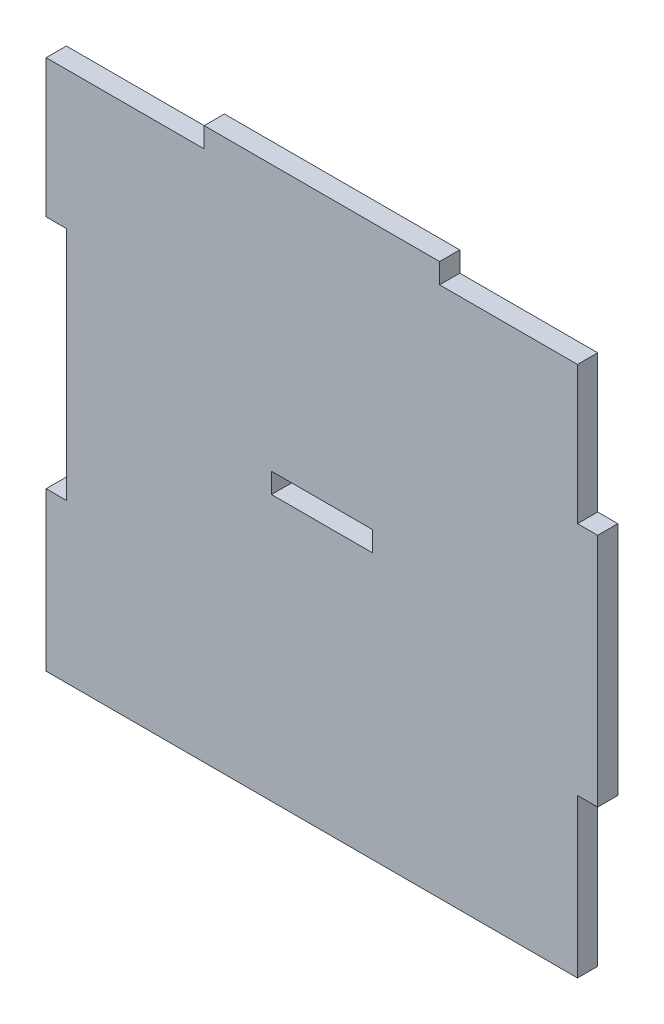
ISO-10303-21;
HEADER;
FILE_DESCRIPTION(('STEP AP214'),'2;1');
FILE_NAME('part.step','',(''),(''),'','','');
FILE_SCHEMA(('AUTOMOTIVE_DESIGN { 1 0 10303 214 1 1 1 1 }'));
ENDSEC;
DATA;
#1=APPLICATION_CONTEXT('core data for automotive mechanical design processes');
#2=APPLICATION_PROTOCOL_DEFINITION('international standard','automotive_design',2000,#1);
#3=PRODUCT_CONTEXT('',#1,'mechanical');
#4=PRODUCT('Part','Part','',(#3));
#5=PRODUCT_RELATED_PRODUCT_CATEGORY('part','',(#4));
#6=PRODUCT_DEFINITION_FORMATION('','',#4);
#7=PRODUCT_DEFINITION_CONTEXT('part definition',#1,'design');
#8=PRODUCT_DEFINITION('design','',#6,#7);
#9=PRODUCT_DEFINITION_SHAPE('','',#8);
#10=(LENGTH_UNIT() NAMED_UNIT(*) SI_UNIT(.MILLI.,.METRE.));
#11=(NAMED_UNIT(*) PLANE_ANGLE_UNIT() SI_UNIT($,.RADIAN.));
#12=(NAMED_UNIT(*) SI_UNIT($,.STERADIAN.) SOLID_ANGLE_UNIT());
#13=UNCERTAINTY_MEASURE_WITH_UNIT(LENGTH_MEASURE(1.E-05),#10,'distance_accuracy_value','');
#14=(GEOMETRIC_REPRESENTATION_CONTEXT(3) GLOBAL_UNCERTAINTY_ASSIGNED_CONTEXT((#13)) GLOBAL_UNIT_ASSIGNED_CONTEXT((#10,
#11,#12)) REPRESENTATION_CONTEXT('',''));
#15=CARTESIAN_POINT('',(0.,0.,0.));
#16=DIRECTION('',(0.,0.,1.));
#17=DIRECTION('',(1.,0.,0.));
#18=AXIS2_PLACEMENT_3D('',#15,#16,#17);
#19=CARTESIAN_POINT('',(38.,-16.,3.));
#20=DIRECTION('',(0.,1.,0.));
#21=DIRECTION('',(-1.,0.,0.));
#22=AXIS2_PLACEMENT_3D('',#19,#20,#21);
#23=PLANE('',#22);
#24=DIRECTION('',(1.,0.,0.));
#25=VECTOR('',#24,1.);
#26=CARTESIAN_POINT('',(38.,-16.,0.));
#27=LINE('',#26,#25);
#28=CARTESIAN_POINT('',(38.,-16.,0.));
#29=VERTEX_POINT('',#28);
#30=CARTESIAN_POINT('',(41.,-16.,0.));
#31=VERTEX_POINT('',#30);
#32=EDGE_CURVE('E218',#29,#31,#27,.T.);
#33=ORIENTED_EDGE('',*,*,#32,.T.);
#34=DIRECTION('',(0.,0.,-1.));
#35=VECTOR('',#34,1.);
#36=CARTESIAN_POINT('',(41.,-16.,3.));
#37=LINE('',#36,#35);
#38=CARTESIAN_POINT('',(41.,-16.,3.));
#39=VERTEX_POINT('',#38);
#40=EDGE_CURVE('E11',#39,#31,#37,.T.);
#41=ORIENTED_EDGE('',*,*,#40,.F.);
#42=DIRECTION('',(1.,0.,0.));
#43=VECTOR('',#42,1.);
#44=CARTESIAN_POINT('',(38.,-16.,3.));
#45=LINE('',#44,#43);
#46=CARTESIAN_POINT('',(38.,-16.,3.));
#47=VERTEX_POINT('',#46);
#48=EDGE_CURVE('E224',#47,#39,#45,.T.);
#49=ORIENTED_EDGE('',*,*,#48,.F.);
#50=DIRECTION('',(0.,0.,-1.));
#51=VECTOR('',#50,1.);
#52=CARTESIAN_POINT('',(38.,-16.,3.));
#53=LINE('',#52,#51);
#54=EDGE_CURVE('E274',#47,#29,#53,.T.);
#55=ORIENTED_EDGE('',*,*,#54,.T.);
#56=EDGE_LOOP('',(#33,#41,#49,#55));
#57=FACE_BOUND('',#56,.T.);
#58=ADVANCED_FACE('F38',(#57),#23,.F.);
#59=CARTESIAN_POINT('',(41.,16.,3.));
#60=DIRECTION('',(-1.,0.,0.));
#61=DIRECTION('',(0.,0.,1.));
#62=AXIS2_PLACEMENT_3D('',#59,#60,#61);
#63=PLANE('',#62);
#64=DIRECTION('',(0.,1.,0.));
#65=VECTOR('',#64,1.);
#66=CARTESIAN_POINT('',(41.,16.,0.));
#67=LINE('',#66,#65);
#68=CARTESIAN_POINT('',(41.,19.,0.));
#69=VERTEX_POINT('',#68);
#70=EDGE_CURVE('E278',#31,#69,#67,.T.);
#71=ORIENTED_EDGE('',*,*,#70,.T.);
#72=DIRECTION('',(0.,0.,-1.));
#73=VECTOR('',#72,1.);
#74=CARTESIAN_POINT('',(41.,19.,3.));
#75=LINE('',#74,#73);
#76=CARTESIAN_POINT('',(41.,19.,3.));
#77=VERTEX_POINT('',#76);
#78=EDGE_CURVE('E46',#77,#69,#75,.T.);
#79=ORIENTED_EDGE('',*,*,#78,.F.);
#80=DIRECTION('',(0.,1.,0.));
#81=VECTOR('',#80,1.);
#82=CARTESIAN_POINT('',(41.,16.,3.));
#83=LINE('',#82,#81);
#84=EDGE_CURVE('E228',#39,#77,#83,.T.);
#85=ORIENTED_EDGE('',*,*,#84,.F.);
#86=ORIENTED_EDGE('',*,*,#40,.T.);
#87=EDGE_LOOP('',(#71,#79,#85,#86));
#88=FACE_BOUND('',#87,.T.);
#89=ADVANCED_FACE('F407',(#88),#63,.F.);
#90=CARTESIAN_POINT('',(41.,19.,3.));
#91=DIRECTION('',(0.,-1.,0.));
#92=DIRECTION('',(0.,0.,-1.));
#93=AXIS2_PLACEMENT_3D('',#90,#91,#92);
#94=PLANE('',#93);
#95=DIRECTION('',(-1.,0.,0.));
#96=VECTOR('',#95,1.);
#97=CARTESIAN_POINT('',(41.,19.,0.));
#98=LINE('',#97,#96);
#99=CARTESIAN_POINT('',(38.,19.,0.));
#100=VERTEX_POINT('',#99);
#101=EDGE_CURVE('E281',#69,#100,#98,.T.);
#102=ORIENTED_EDGE('',*,*,#101,.T.);
#103=DIRECTION('',(0.,0.,-1.));
#104=VECTOR('',#103,1.);
#105=CARTESIAN_POINT('',(38.,19.,3.));
#106=LINE('',#105,#104);
#107=CARTESIAN_POINT('',(38.,19.,3.));
#108=VERTEX_POINT('',#107);
#109=EDGE_CURVE('E377',#108,#100,#106,.T.);
#110=ORIENTED_EDGE('',*,*,#109,.F.);
#111=DIRECTION('',(-1.,0.,0.));
#112=VECTOR('',#111,1.);
#113=CARTESIAN_POINT('',(41.,19.,3.));
#114=LINE('',#113,#112);
#115=EDGE_CURVE('E232',#77,#108,#114,.T.);
#116=ORIENTED_EDGE('',*,*,#115,.F.);
#117=ORIENTED_EDGE('',*,*,#78,.T.);
#118=EDGE_LOOP('',(#102,#110,#116,#117));
#119=FACE_BOUND('',#118,.T.);
#120=ADVANCED_FACE('F386',(#119),#94,.F.);
#121=CARTESIAN_POINT('',(38.,39.5,3.));
#122=DIRECTION('',(-1.,0.,0.));
#123=DIRECTION('',(0.,-1.,0.));
#124=AXIS2_PLACEMENT_3D('',#121,#122,#123);
#125=PLANE('',#124);
#126=DIRECTION('',(0.,1.,0.));
#127=VECTOR('',#126,1.);
#128=CARTESIAN_POINT('',(38.,39.5,0.));
#129=LINE('',#128,#127);
#130=CARTESIAN_POINT('',(38.,39.5,0.));
#131=VERTEX_POINT('',#130);
#132=EDGE_CURVE('E284',#100,#131,#129,.T.);
#133=ORIENTED_EDGE('',*,*,#132,.T.);
#134=DIRECTION('',(0.,0.,-1.));
#135=VECTOR('',#134,1.);
#136=CARTESIAN_POINT('',(38.,39.5,3.));
#137=LINE('',#136,#135);
#138=CARTESIAN_POINT('',(38.,39.5,3.));
#139=VERTEX_POINT('',#138);
#140=EDGE_CURVE('E373',#139,#131,#137,.T.);
#141=ORIENTED_EDGE('',*,*,#140,.F.);
#142=DIRECTION('',(0.,1.,0.));
#143=VECTOR('',#142,1.);
#144=CARTESIAN_POINT('',(38.,39.5,3.));
#145=LINE('',#144,#143);
#146=EDGE_CURVE('E235',#108,#139,#145,.T.);
#147=ORIENTED_EDGE('',*,*,#146,.F.);
#148=ORIENTED_EDGE('',*,*,#109,.T.);
#149=EDGE_LOOP('',(#133,#141,#147,#148));
#150=FACE_BOUND('',#149,.T.);
#151=ADVANCED_FACE('F395',(#150),#125,.F.);
#152=CARTESIAN_POINT('',(17.5,39.5,3.));
#153=DIRECTION('',(0.,-1.,0.));
#154=DIRECTION('',(1.,0.,0.));
#155=AXIS2_PLACEMENT_3D('',#152,#153,#154);
#156=PLANE('',#155);
#157=DIRECTION('',(-1.,0.,0.));
#158=VECTOR('',#157,1.);
#159=CARTESIAN_POINT('',(17.5,39.5,0.));
#160=LINE('',#159,#158);
#161=CARTESIAN_POINT('',(17.5,39.5,0.));
#162=VERTEX_POINT('',#161);
#163=EDGE_CURVE('E287',#131,#162,#160,.T.);
#164=ORIENTED_EDGE('',*,*,#163,.T.);
#165=DIRECTION('',(0.,0.,-1.));
#166=VECTOR('',#165,1.);
#167=CARTESIAN_POINT('',(17.5,39.5,3.));
#168=LINE('',#167,#166);
#169=CARTESIAN_POINT('',(17.5,39.5,3.));
#170=VERTEX_POINT('',#169);
#171=EDGE_CURVE('E369',#170,#162,#168,.T.);
#172=ORIENTED_EDGE('',*,*,#171,.F.);
#173=DIRECTION('',(-1.,0.,0.));
#174=VECTOR('',#173,1.);
#175=CARTESIAN_POINT('',(17.5,39.5,3.));
#176=LINE('',#175,#174);
#177=EDGE_CURVE('E238',#139,#170,#176,.T.);
#178=ORIENTED_EDGE('',*,*,#177,.F.);
#179=ORIENTED_EDGE('',*,*,#140,.T.);
#180=EDGE_LOOP('',(#164,#172,#178,#179));
#181=FACE_BOUND('',#180,.T.);
#182=ADVANCED_FACE('F399',(#181),#156,.F.);
#183=CARTESIAN_POINT('',(17.5,42.5,3.));
#184=DIRECTION('',(-1.,0.,0.));
#185=DIRECTION('',(0.,-1.,0.));
#186=AXIS2_PLACEMENT_3D('',#183,#184,#185);
#187=PLANE('',#186);
#188=DIRECTION('',(0.,1.,0.));
#189=VECTOR('',#188,1.);
#190=CARTESIAN_POINT('',(17.5,42.5,0.));
#191=LINE('',#190,#189);
#192=CARTESIAN_POINT('',(17.5,42.5,0.));
#193=VERTEX_POINT('',#192);
#194=EDGE_CURVE('E290',#162,#193,#191,.T.);
#195=ORIENTED_EDGE('',*,*,#194,.T.);
#196=DIRECTION('',(0.,0.,-1.));
#197=VECTOR('',#196,1.);
#198=CARTESIAN_POINT('',(17.5,42.5,3.));
#199=LINE('',#198,#197);
#200=CARTESIAN_POINT('',(17.5,42.5,3.));
#201=VERTEX_POINT('',#200);
#202=EDGE_CURVE('E365',#201,#193,#199,.T.);
#203=ORIENTED_EDGE('',*,*,#202,.F.);
#204=DIRECTION('',(0.,1.,0.));
#205=VECTOR('',#204,1.);
#206=CARTESIAN_POINT('',(17.5,42.5,3.));
#207=LINE('',#206,#205);
#208=EDGE_CURVE('E241',#170,#201,#207,.T.);
#209=ORIENTED_EDGE('',*,*,#208,.F.);
#210=ORIENTED_EDGE('',*,*,#171,.T.);
#211=EDGE_LOOP('',(#195,#203,#209,#210));
#212=FACE_BOUND('',#211,.T.);
#213=ADVANCED_FACE('F456',(#212),#187,.F.);
#214=CARTESIAN_POINT('',(-17.5,42.5,3.));
#215=DIRECTION('',(0.,-1.,0.));
#216=DIRECTION('',(0.,0.,-1.));
#217=AXIS2_PLACEMENT_3D('',#214,#215,#216);
#218=PLANE('',#217);
#219=DIRECTION('',(-1.,0.,0.));
#220=VECTOR('',#219,1.);
#221=CARTESIAN_POINT('',(-17.5,42.5,0.));
#222=LINE('',#221,#220);
#223=CARTESIAN_POINT('',(-17.5,42.5,0.));
#224=VERTEX_POINT('',#223);
#225=EDGE_CURVE('E293',#193,#224,#222,.T.);
#226=ORIENTED_EDGE('',*,*,#225,.T.);
#227=DIRECTION('',(0.,0.,-1.));
#228=VECTOR('',#227,1.);
#229=CARTESIAN_POINT('',(-17.5,42.5,3.));
#230=LINE('',#229,#228);
#231=CARTESIAN_POINT('',(-17.5,42.5,3.));
#232=VERTEX_POINT('',#231);
#233=EDGE_CURVE('E361',#232,#224,#230,.T.);
#234=ORIENTED_EDGE('',*,*,#233,.F.);
#235=DIRECTION('',(-1.,0.,0.));
#236=VECTOR('',#235,1.);
#237=CARTESIAN_POINT('',(-17.5,42.5,3.));
#238=LINE('',#237,#236);
#239=EDGE_CURVE('E244',#201,#232,#238,.T.);
#240=ORIENTED_EDGE('',*,*,#239,.F.);
#241=ORIENTED_EDGE('',*,*,#202,.T.);
#242=EDGE_LOOP('',(#226,#234,#240,#241));
#243=FACE_BOUND('',#242,.T.);
#244=ADVANCED_FACE('F454',(#243),#218,.F.);
#245=CARTESIAN_POINT('',(-17.5,39.5,3.));
#246=DIRECTION('',(1.,0.,0.));
#247=DIRECTION('',(0.,0.,-1.));
#248=AXIS2_PLACEMENT_3D('',#245,#246,#247);
#249=PLANE('',#248);
#250=DIRECTION('',(0.,-1.,0.));
#251=VECTOR('',#250,1.);
#252=CARTESIAN_POINT('',(-17.5,39.5,0.));
#253=LINE('',#252,#251);
#254=CARTESIAN_POINT('',(-17.5,39.5,0.));
#255=VERTEX_POINT('',#254);
#256=EDGE_CURVE('E296',#224,#255,#253,.T.);
#257=ORIENTED_EDGE('',*,*,#256,.T.);
#258=DIRECTION('',(0.,0.,-1.));
#259=VECTOR('',#258,1.);
#260=CARTESIAN_POINT('',(-17.5,39.5,3.));
#261=LINE('',#260,#259);
#262=CARTESIAN_POINT('',(-17.5,39.5,3.));
#263=VERTEX_POINT('',#262);
#264=EDGE_CURVE('E357',#263,#255,#261,.T.);
#265=ORIENTED_EDGE('',*,*,#264,.F.);
#266=DIRECTION('',(0.,-1.,0.));
#267=VECTOR('',#266,1.);
#268=CARTESIAN_POINT('',(-17.5,39.5,3.));
#269=LINE('',#268,#267);
#270=EDGE_CURVE('E247',#232,#263,#269,.T.);
#271=ORIENTED_EDGE('',*,*,#270,.F.);
#272=ORIENTED_EDGE('',*,*,#233,.T.);
#273=EDGE_LOOP('',(#257,#265,#271,#272));
#274=FACE_BOUND('',#273,.T.);
#275=ADVANCED_FACE('F447',(#274),#249,.F.);
#276=CARTESIAN_POINT('',(-41.,39.5,3.));
#277=DIRECTION('',(0.,-1.,0.));
#278=DIRECTION('',(0.,0.,-1.));
#279=AXIS2_PLACEMENT_3D('',#276,#277,#278);
#280=PLANE('',#279);
#281=DIRECTION('',(-1.,0.,0.));
#282=VECTOR('',#281,1.);
#283=CARTESIAN_POINT('',(-41.,39.5,0.));
#284=LINE('',#283,#282);
#285=CARTESIAN_POINT('',(-41.,39.5,0.));
#286=VERTEX_POINT('',#285);
#287=EDGE_CURVE('E300',#255,#286,#284,.T.);
#288=ORIENTED_EDGE('',*,*,#287,.T.);
#289=DIRECTION('',(0.,0.,-1.));
#290=VECTOR('',#289,1.);
#291=CARTESIAN_POINT('',(-41.,39.5,3.));
#292=LINE('',#291,#290);
#293=CARTESIAN_POINT('',(-41.,39.5,3.));
#294=VERTEX_POINT('',#293);
#295=EDGE_CURVE('E353',#294,#286,#292,.T.);
#296=ORIENTED_EDGE('',*,*,#295,.F.);
#297=DIRECTION('',(-1.,0.,0.));
#298=VECTOR('',#297,1.);
#299=CARTESIAN_POINT('',(-38.,39.5,3.));
#300=LINE('',#299,#298);
#301=EDGE_CURVE('E250',#263,#294,#300,.T.);
#302=ORIENTED_EDGE('',*,*,#301,.F.);
#303=ORIENTED_EDGE('',*,*,#264,.T.);
#304=EDGE_LOOP('',(#288,#296,#302,#303));
#305=FACE_BOUND('',#304,.T.);
#306=ADVANCED_FACE('F451',(#305),#280,.F.);
#307=CARTESIAN_POINT('',(-41.,19.,3.));
#308=DIRECTION('',(1.,0.,0.));
#309=DIRECTION('',(0.,1.,0.));
#310=AXIS2_PLACEMENT_3D('',#307,#308,#309);
#311=PLANE('',#310);
#312=DIRECTION('',(0.,-1.,0.));
#313=VECTOR('',#312,1.);
#314=CARTESIAN_POINT('',(-41.,19.,0.));
#315=LINE('',#314,#313);
#316=CARTESIAN_POINT('',(-41.,19.,0.));
#317=VERTEX_POINT('',#316);
#318=EDGE_CURVE('E303',#286,#317,#315,.T.);
#319=ORIENTED_EDGE('',*,*,#318,.T.);
#320=DIRECTION('',(0.,0.,-1.));
#321=VECTOR('',#320,1.);
#322=CARTESIAN_POINT('',(-41.,19.,3.));
#323=LINE('',#322,#321);
#324=CARTESIAN_POINT('',(-41.,19.,3.));
#325=VERTEX_POINT('',#324);
#326=EDGE_CURVE('E349',#325,#317,#323,.T.);
#327=ORIENTED_EDGE('',*,*,#326,.F.);
#328=DIRECTION('',(0.,-1.,0.));
#329=VECTOR('',#328,1.);
#330=CARTESIAN_POINT('',(-41.,19.,3.));
#331=LINE('',#330,#329);
#332=EDGE_CURVE('E253',#294,#325,#331,.T.);
#333=ORIENTED_EDGE('',*,*,#332,.F.);
#334=ORIENTED_EDGE('',*,*,#295,.T.);
#335=EDGE_LOOP('',(#319,#327,#333,#334));
#336=FACE_BOUND('',#335,.T.);
#337=ADVANCED_FACE('F440',(#336),#311,.F.);
#338=CARTESIAN_POINT('',(-38.,19.,3.));
#339=DIRECTION('',(0.,1.,0.));
#340=DIRECTION('',(-1.,0.,0.));
#341=AXIS2_PLACEMENT_3D('',#338,#339,#340);
#342=PLANE('',#341);
#343=DIRECTION('',(1.,0.,0.));
#344=VECTOR('',#343,1.);
#345=CARTESIAN_POINT('',(-38.,19.,0.));
#346=LINE('',#345,#344);
#347=CARTESIAN_POINT('',(-38.,19.,0.));
#348=VERTEX_POINT('',#347);
#349=EDGE_CURVE('E306',#317,#348,#346,.T.);
#350=ORIENTED_EDGE('',*,*,#349,.T.);
#351=DIRECTION('',(0.,0.,-1.));
#352=VECTOR('',#351,1.);
#353=CARTESIAN_POINT('',(-38.,19.,3.));
#354=LINE('',#353,#352);
#355=CARTESIAN_POINT('',(-38.,19.,3.));
#356=VERTEX_POINT('',#355);
#357=EDGE_CURVE('E345',#356,#348,#354,.T.);
#358=ORIENTED_EDGE('',*,*,#357,.F.);
#359=DIRECTION('',(1.,0.,0.));
#360=VECTOR('',#359,1.);
#361=CARTESIAN_POINT('',(-38.,19.,3.));
#362=LINE('',#361,#360);
#363=EDGE_CURVE('E256',#325,#356,#362,.T.);
#364=ORIENTED_EDGE('',*,*,#363,.F.);
#365=ORIENTED_EDGE('',*,*,#326,.T.);
#366=EDGE_LOOP('',(#350,#358,#364,#365));
#367=FACE_BOUND('',#366,.T.);
#368=ADVANCED_FACE('F435',(#367),#342,.F.);
#369=CARTESIAN_POINT('',(-38.,16.,3.));
#370=DIRECTION('',(1.,0.,0.));
#371=DIRECTION('',(0.,0.,-1.));
#372=AXIS2_PLACEMENT_3D('',#369,#370,#371);
#373=PLANE('',#372);
#374=DIRECTION('',(0.,-1.,0.));
#375=VECTOR('',#374,1.);
#376=CARTESIAN_POINT('',(-38.,16.,0.));
#377=LINE('',#376,#375);
#378=CARTESIAN_POINT('',(-38.,-16.,0.));
#379=VERTEX_POINT('',#378);
#380=EDGE_CURVE('E310',#348,#379,#377,.T.);
#381=ORIENTED_EDGE('',*,*,#380,.T.);
#382=DIRECTION('',(0.,0.,-1.));
#383=VECTOR('',#382,1.);
#384=CARTESIAN_POINT('',(-38.,-16.,3.));
#385=LINE('',#384,#383);
#386=CARTESIAN_POINT('',(-38.,-16.,3.));
#387=VERTEX_POINT('',#386);
#388=EDGE_CURVE('E341',#387,#379,#385,.T.);
#389=ORIENTED_EDGE('',*,*,#388,.F.);
#390=DIRECTION('',(0.,-1.,0.));
#391=VECTOR('',#390,1.);
#392=CARTESIAN_POINT('',(-38.,16.,3.));
#393=LINE('',#392,#391);
#394=EDGE_CURVE('E259',#356,#387,#393,.T.);
#395=ORIENTED_EDGE('',*,*,#394,.F.);
#396=ORIENTED_EDGE('',*,*,#357,.T.);
#397=EDGE_LOOP('',(#381,#389,#395,#396));
#398=FACE_BOUND('',#397,.T.);
#399=ADVANCED_FACE('F430',(#398),#373,.F.);
#400=CARTESIAN_POINT('',(-41.,-16.,3.));
#401=DIRECTION('',(0.,-1.,0.));
#402=DIRECTION('',(0.,0.,-1.));
#403=AXIS2_PLACEMENT_3D('',#400,#401,#402);
#404=PLANE('',#403);
#405=DIRECTION('',(-1.,0.,0.));
#406=VECTOR('',#405,1.);
#407=CARTESIAN_POINT('',(-41.,-16.,0.));
#408=LINE('',#407,#406);
#409=CARTESIAN_POINT('',(-41.,-16.,0.));
#410=VERTEX_POINT('',#409);
#411=EDGE_CURVE('E313',#379,#410,#408,.T.);
#412=ORIENTED_EDGE('',*,*,#411,.T.);
#413=DIRECTION('',(0.,0.,-1.));
#414=VECTOR('',#413,1.);
#415=CARTESIAN_POINT('',(-41.,-16.,3.));
#416=LINE('',#415,#414);
#417=CARTESIAN_POINT('',(-41.,-16.,3.));
#418=VERTEX_POINT('',#417);
#419=EDGE_CURVE('E337',#418,#410,#416,.T.);
#420=ORIENTED_EDGE('',*,*,#419,.F.);
#421=DIRECTION('',(-1.,0.,0.));
#422=VECTOR('',#421,1.);
#423=CARTESIAN_POINT('',(-41.,-16.,3.));
#424=LINE('',#423,#422);
#425=EDGE_CURVE('E262',#387,#418,#424,.T.);
#426=ORIENTED_EDGE('',*,*,#425,.F.);
#427=ORIENTED_EDGE('',*,*,#388,.T.);
#428=EDGE_LOOP('',(#412,#420,#426,#427));
#429=FACE_BOUND('',#428,.T.);
#430=ADVANCED_FACE('F426',(#429),#404,.F.);
#431=CARTESIAN_POINT('',(-41.,-19.,3.));
#432=DIRECTION('',(1.,0.,0.));
#433=DIRECTION('',(0.,1.,0.));
#434=AXIS2_PLACEMENT_3D('',#431,#432,#433);
#435=PLANE('',#434);
#436=DIRECTION('',(0.,-1.,0.));
#437=VECTOR('',#436,1.);
#438=CARTESIAN_POINT('',(-41.,-19.,0.));
#439=LINE('',#438,#437);
#440=CARTESIAN_POINT('',(-41.,-39.5,0.));
#441=VERTEX_POINT('',#440);
#442=EDGE_CURVE('E317',#410,#441,#439,.T.);
#443=ORIENTED_EDGE('',*,*,#442,.T.);
#444=DIRECTION('',(0.,0.,-1.));
#445=VECTOR('',#444,1.);
#446=CARTESIAN_POINT('',(-41.,-39.5,3.));
#447=LINE('',#446,#445);
#448=CARTESIAN_POINT('',(-41.,-39.5,3.));
#449=VERTEX_POINT('',#448);
#450=EDGE_CURVE('E333',#449,#441,#447,.T.);
#451=ORIENTED_EDGE('',*,*,#450,.F.);
#452=DIRECTION('',(0.,-1.,0.));
#453=VECTOR('',#452,1.);
#454=CARTESIAN_POINT('',(-41.,-19.,3.));
#455=LINE('',#454,#453);
#456=EDGE_CURVE('E265',#418,#449,#455,.T.);
#457=ORIENTED_EDGE('',*,*,#456,.F.);
#458=ORIENTED_EDGE('',*,*,#419,.T.);
#459=EDGE_LOOP('',(#443,#451,#457,#458));
#460=FACE_BOUND('',#459,.T.);
#461=ADVANCED_FACE('F423',(#460),#435,.F.);
#462=CARTESIAN_POINT('',(-41.,-39.5,3.));
#463=DIRECTION('',(0.,1.,0.));
#464=DIRECTION('',(0.,0.,1.));
#465=AXIS2_PLACEMENT_3D('',#462,#463,#464);
#466=PLANE('',#465);
#467=DIRECTION('',(1.,0.,0.));
#468=VECTOR('',#467,1.);
#469=CARTESIAN_POINT('',(-41.,-39.5,0.));
#470=LINE('',#469,#468);
#471=CARTESIAN_POINT('',(38.,-39.5,0.));
#472=VERTEX_POINT('',#471);
#473=EDGE_CURVE('E320',#441,#472,#470,.T.);
#474=ORIENTED_EDGE('',*,*,#473,.T.);
#475=DIRECTION('',(0.,0.,-1.));
#476=VECTOR('',#475,1.);
#477=CARTESIAN_POINT('',(38.,-39.5,3.));
#478=LINE('',#477,#476);
#479=CARTESIAN_POINT('',(38.,-39.5,3.));
#480=VERTEX_POINT('',#479);
#481=EDGE_CURVE('E329',#480,#472,#478,.T.);
#482=ORIENTED_EDGE('',*,*,#481,.F.);
#483=DIRECTION('',(1.,0.,0.));
#484=VECTOR('',#483,1.);
#485=CARTESIAN_POINT('',(-41.,-39.5,3.));
#486=LINE('',#485,#484);
#487=EDGE_CURVE('E268',#449,#480,#486,.T.);
#488=ORIENTED_EDGE('',*,*,#487,.F.);
#489=ORIENTED_EDGE('',*,*,#450,.T.);
#490=EDGE_LOOP('',(#474,#482,#488,#489));
#491=FACE_BOUND('',#490,.T.);
#492=ADVANCED_FACE('F414',(#491),#466,.F.);
#493=CARTESIAN_POINT('',(38.,-19.,3.));
#494=DIRECTION('',(-1.,0.,0.));
#495=DIRECTION('',(0.,-1.,0.));
#496=AXIS2_PLACEMENT_3D('',#493,#494,#495);
#497=PLANE('',#496);
#498=DIRECTION('',(0.,1.,0.));
#499=VECTOR('',#498,1.);
#500=CARTESIAN_POINT('',(38.,-19.,0.));
#501=LINE('',#500,#499);
#502=EDGE_CURVE('E229',#472,#29,#501,.T.);
#503=ORIENTED_EDGE('',*,*,#502,.T.);
#504=ORIENTED_EDGE('',*,*,#54,.F.);
#505=DIRECTION('',(0.,1.,0.));
#506=VECTOR('',#505,1.);
#507=CARTESIAN_POINT('',(38.,-19.,3.));
#508=LINE('',#507,#506);
#509=EDGE_CURVE('E271',#480,#47,#508,.T.);
#510=ORIENTED_EDGE('',*,*,#509,.F.);
#511=ORIENTED_EDGE('',*,*,#481,.T.);
#512=EDGE_LOOP('',(#503,#504,#510,#511));
#513=FACE_BOUND('',#512,.T.);
#514=ADVANCED_FACE('F418',(#513),#497,.F.);
#515=CARTESIAN_POINT('',(0.,0.,3.));
#516=DIRECTION('',(0.,0.,-1.));
#517=DIRECTION('',(-1.,0.,0.));
#518=AXIS2_PLACEMENT_3D('',#515,#516,#517);
#519=PLANE('',#518);
#520=DIRECTION('',(-1.,0.,0.));
#521=VECTOR('',#520,1.);
#522=CARTESIAN_POINT('',(-7.5,3.,3.));
#523=LINE('',#522,#521);
#524=CARTESIAN_POINT('',(7.5,3.,3.));
#525=VERTEX_POINT('',#524);
#526=CARTESIAN_POINT('',(-7.5,3.,3.));
#527=VERTEX_POINT('',#526);
#528=EDGE_CURVE('E209',#525,#527,#523,.T.);
#529=ORIENTED_EDGE('',*,*,#528,.F.);
#530=DIRECTION('',(0.,1.,0.));
#531=VECTOR('',#530,1.);
#532=CARTESIAN_POINT('',(7.5,3.,3.));
#533=LINE('',#532,#531);
#534=CARTESIAN_POINT('',(7.5,0.,3.));
#535=VERTEX_POINT('',#534);
#536=EDGE_CURVE('E53',#535,#525,#533,.T.);
#537=ORIENTED_EDGE('',*,*,#536,.F.);
#538=DIRECTION('',(1.,0.,0.));
#539=VECTOR('',#538,1.);
#540=CARTESIAN_POINT('',(-7.5,0.,3.));
#541=LINE('',#540,#539);
#542=CARTESIAN_POINT('',(-7.5,0.,3.));
#543=VERTEX_POINT('',#542);
#544=EDGE_CURVE('E196',#543,#535,#541,.T.);
#545=ORIENTED_EDGE('',*,*,#544,.F.);
#546=DIRECTION('',(0.,-1.,0.));
#547=VECTOR('',#546,1.);
#548=CARTESIAN_POINT('',(-7.5,3.,3.));
#549=LINE('',#548,#547);
#550=EDGE_CURVE('E200',#527,#543,#549,.T.);
#551=ORIENTED_EDGE('',*,*,#550,.F.);
#552=EDGE_LOOP('',(#529,#537,#545,#551));
#553=FACE_BOUND('',#552,.T.);
#554=ORIENTED_EDGE('',*,*,#48,.T.);
#555=ORIENTED_EDGE('',*,*,#84,.T.);
#556=ORIENTED_EDGE('',*,*,#115,.T.);
#557=ORIENTED_EDGE('',*,*,#146,.T.);
#558=ORIENTED_EDGE('',*,*,#177,.T.);
#559=ORIENTED_EDGE('',*,*,#208,.T.);
#560=ORIENTED_EDGE('',*,*,#239,.T.);
#561=ORIENTED_EDGE('',*,*,#270,.T.);
#562=ORIENTED_EDGE('',*,*,#301,.T.);
#563=ORIENTED_EDGE('',*,*,#332,.T.);
#564=ORIENTED_EDGE('',*,*,#363,.T.);
#565=ORIENTED_EDGE('',*,*,#394,.T.);
#566=ORIENTED_EDGE('',*,*,#425,.T.);
#567=ORIENTED_EDGE('',*,*,#456,.T.);
#568=ORIENTED_EDGE('',*,*,#487,.T.);
#569=ORIENTED_EDGE('',*,*,#509,.T.);
#570=EDGE_LOOP('',(#554,#555,#556,#557,#558,#559,#560,#561,#562,#563,#564,#565,#566,#567,#568,#569));
#571=FACE_BOUND('',#570,.T.);
#572=ADVANCED_FACE('F403',(#553,#571),#519,.F.);
#573=CARTESIAN_POINT('',(0.,0.,0.));
#574=DIRECTION('',(0.,0.,-1.));
#575=DIRECTION('',(-1.,0.,0.));
#576=AXIS2_PLACEMENT_3D('',#573,#574,#575);
#577=PLANE('',#576);
#578=DIRECTION('',(0.,1.,0.));
#579=VECTOR('',#578,1.);
#580=CARTESIAN_POINT('',(7.5,3.,0.));
#581=LINE('',#580,#579);
#582=CARTESIAN_POINT('',(7.5,0.,0.));
#583=VERTEX_POINT('',#582);
#584=CARTESIAN_POINT('',(7.5,3.,0.));
#585=VERTEX_POINT('',#584);
#586=EDGE_CURVE('E177',#583,#585,#581,.T.);
#587=ORIENTED_EDGE('',*,*,#586,.T.);
#588=DIRECTION('',(-1.,0.,0.));
#589=VECTOR('',#588,1.);
#590=CARTESIAN_POINT('',(-7.5,3.,0.));
#591=LINE('',#590,#589);
#592=CARTESIAN_POINT('',(-7.5,3.,0.));
#593=VERTEX_POINT('',#592);
#594=EDGE_CURVE('E187',#585,#593,#591,.T.);
#595=ORIENTED_EDGE('',*,*,#594,.T.);
#596=DIRECTION('',(0.,-1.,0.));
#597=VECTOR('',#596,1.);
#598=CARTESIAN_POINT('',(-7.5,3.,0.));
#599=LINE('',#598,#597);
#600=CARTESIAN_POINT('',(-7.5,0.,0.));
#601=VERTEX_POINT('',#600);
#602=EDGE_CURVE('E61',#593,#601,#599,.T.);
#603=ORIENTED_EDGE('',*,*,#602,.T.);
#604=DIRECTION('',(1.,0.,0.));
#605=VECTOR('',#604,1.);
#606=CARTESIAN_POINT('',(-7.5,0.,0.));
#607=LINE('',#606,#605);
#608=EDGE_CURVE('E184',#601,#583,#607,.T.);
#609=ORIENTED_EDGE('',*,*,#608,.T.);
#610=EDGE_LOOP('',(#587,#595,#603,#609));
#611=FACE_BOUND('',#610,.T.);
#612=ORIENTED_EDGE('',*,*,#32,.F.);
#613=ORIENTED_EDGE('',*,*,#502,.F.);
#614=ORIENTED_EDGE('',*,*,#473,.F.);
#615=ORIENTED_EDGE('',*,*,#442,.F.);
#616=ORIENTED_EDGE('',*,*,#411,.F.);
#617=ORIENTED_EDGE('',*,*,#380,.F.);
#618=ORIENTED_EDGE('',*,*,#349,.F.);
#619=ORIENTED_EDGE('',*,*,#318,.F.);
#620=ORIENTED_EDGE('',*,*,#287,.F.);
#621=ORIENTED_EDGE('',*,*,#256,.F.);
#622=ORIENTED_EDGE('',*,*,#225,.F.);
#623=ORIENTED_EDGE('',*,*,#194,.F.);
#624=ORIENTED_EDGE('',*,*,#163,.F.);
#625=ORIENTED_EDGE('',*,*,#132,.F.);
#626=ORIENTED_EDGE('',*,*,#101,.F.);
#627=ORIENTED_EDGE('',*,*,#70,.F.);
#628=EDGE_LOOP('',(#612,#613,#614,#615,#616,#617,#618,#619,#620,#621,#622,#623,#624,#625,#626,#627));
#629=FACE_BOUND('',#628,.T.);
#630=ADVANCED_FACE('F192',(#611,#629),#577,.T.);
#631=CARTESIAN_POINT('',(7.5,3.,0.));
#632=DIRECTION('',(1.,0.,0.));
#633=DIRECTION('',(0.,1.,0.));
#634=AXIS2_PLACEMENT_3D('',#631,#632,#633);
#635=PLANE('',#634);
#636=ORIENTED_EDGE('',*,*,#536,.T.);
#637=DIRECTION('',(0.,0.,1.));
#638=VECTOR('',#637,1.);
#639=CARTESIAN_POINT('',(7.5,3.,0.));
#640=LINE('',#639,#638);
#641=EDGE_CURVE('E173',#585,#525,#640,.T.);
#642=ORIENTED_EDGE('',*,*,#641,.F.);
#643=ORIENTED_EDGE('',*,*,#586,.F.);
#644=DIRECTION('',(0.,0.,1.));
#645=VECTOR('',#644,1.);
#646=CARTESIAN_POINT('',(7.5,0.,0.));
#647=LINE('',#646,#645);
#648=EDGE_CURVE('E215',#583,#535,#647,.T.);
#649=ORIENTED_EDGE('',*,*,#648,.T.);
#650=EDGE_LOOP('',(#636,#642,#643,#649));
#651=FACE_BOUND('',#650,.T.);
#652=ADVANCED_FACE('F175',(#651),#635,.F.);
#653=CARTESIAN_POINT('',(-7.5,0.,0.));
#654=DIRECTION('',(0.,-1.,0.));
#655=DIRECTION('',(0.,0.,-1.));
#656=AXIS2_PLACEMENT_3D('',#653,#654,#655);
#657=PLANE('',#656);
#658=ORIENTED_EDGE('',*,*,#544,.T.);
#659=ORIENTED_EDGE('',*,*,#648,.F.);
#660=ORIENTED_EDGE('',*,*,#608,.F.);
#661=DIRECTION('',(0.,0.,1.));
#662=VECTOR('',#661,1.);
#663=CARTESIAN_POINT('',(-7.5,0.,0.));
#664=LINE('',#663,#662);
#665=EDGE_CURVE('E219',#601,#543,#664,.T.);
#666=ORIENTED_EDGE('',*,*,#665,.T.);
#667=EDGE_LOOP('',(#658,#659,#660,#666));
#668=FACE_BOUND('',#667,.T.);
#669=ADVANCED_FACE('F591',(#668),#657,.F.);
#670=CARTESIAN_POINT('',(-7.5,3.,0.));
#671=DIRECTION('',(-1.,0.,0.));
#672=DIRECTION('',(0.,-1.,0.));
#673=AXIS2_PLACEMENT_3D('',#670,#671,#672);
#674=PLANE('',#673);
#675=ORIENTED_EDGE('',*,*,#550,.T.);
#676=ORIENTED_EDGE('',*,*,#665,.F.);
#677=ORIENTED_EDGE('',*,*,#602,.F.);
#678=DIRECTION('',(0.,0.,1.));
#679=VECTOR('',#678,1.);
#680=CARTESIAN_POINT('',(-7.5,3.,0.));
#681=LINE('',#680,#679);
#682=EDGE_CURVE('E183',#593,#527,#681,.T.);
#683=ORIENTED_EDGE('',*,*,#682,.T.);
#684=EDGE_LOOP('',(#675,#676,#677,#683));
#685=FACE_BOUND('',#684,.T.);
#686=ADVANCED_FACE('F600',(#685),#674,.F.);
#687=CARTESIAN_POINT('',(-7.5,3.,0.));
#688=DIRECTION('',(0.,1.,0.));
#689=DIRECTION('',(0.,0.,1.));
#690=AXIS2_PLACEMENT_3D('',#687,#688,#689);
#691=PLANE('',#690);
#692=ORIENTED_EDGE('',*,*,#528,.T.);
#693=ORIENTED_EDGE('',*,*,#682,.F.);
#694=ORIENTED_EDGE('',*,*,#594,.F.);
#695=ORIENTED_EDGE('',*,*,#641,.T.);
#696=EDGE_LOOP('',(#692,#693,#694,#695));
#697=FACE_BOUND('',#696,.T.);
#698=ADVANCED_FACE('F188',(#697),#691,.F.);
#699=CLOSED_SHELL('',(#58,#89,#120,#151,#182,#213,#244,#275,#306,#337,#368,#399,#430,#461,#492,
#514,#572,#630,#652,#669,#686,#698));
#700=MANIFOLD_SOLID_BREP('B2',#699);
#701=ADVANCED_BREP_SHAPE_REPRESENTATION('',(#18,#700),#14);
#702=SHAPE_DEFINITION_REPRESENTATION(#9,#701);
ENDSEC;
END-ISO-10303-21;
